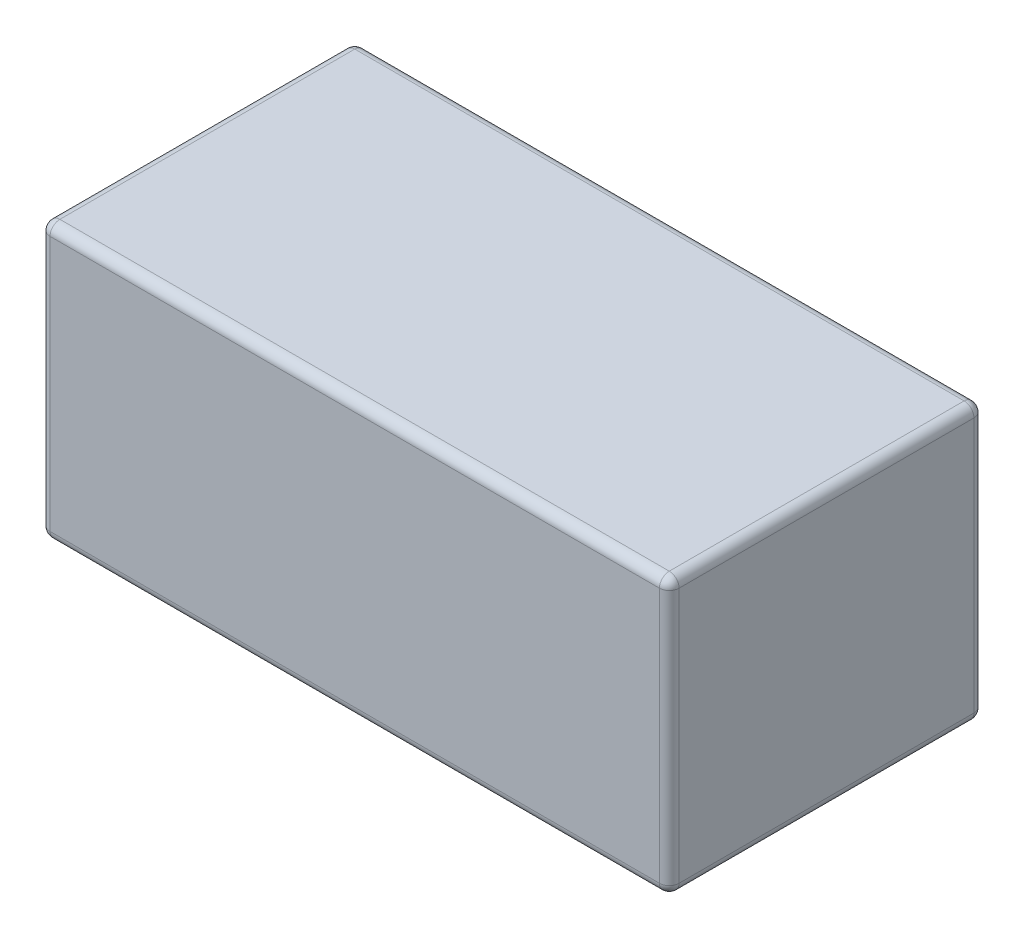
ISO-10303-21;
HEADER;
FILE_DESCRIPTION(('STEP AP214'),'2;1');
FILE_NAME('part.step','',(''),(''),'','','');
FILE_SCHEMA(('AUTOMOTIVE_DESIGN { 1 0 10303 214 1 1 1 1 }'));
ENDSEC;
DATA;
#1=APPLICATION_CONTEXT('core data for automotive mechanical design processes');
#2=APPLICATION_PROTOCOL_DEFINITION('international standard','automotive_design',2000,#1);
#3=PRODUCT_CONTEXT('',#1,'mechanical');
#4=PRODUCT('Part','Part','',(#3));
#5=PRODUCT_RELATED_PRODUCT_CATEGORY('part','',(#4));
#6=PRODUCT_DEFINITION_FORMATION('','',#4);
#7=PRODUCT_DEFINITION_CONTEXT('part definition',#1,'design');
#8=PRODUCT_DEFINITION('design','',#6,#7);
#9=PRODUCT_DEFINITION_SHAPE('','',#8);
#10=(LENGTH_UNIT() NAMED_UNIT(*) SI_UNIT(.MILLI.,.METRE.));
#11=(NAMED_UNIT(*) PLANE_ANGLE_UNIT() SI_UNIT($,.RADIAN.));
#12=(NAMED_UNIT(*) SI_UNIT($,.STERADIAN.) SOLID_ANGLE_UNIT());
#13=UNCERTAINTY_MEASURE_WITH_UNIT(LENGTH_MEASURE(1.E-05),#10,'distance_accuracy_value','');
#14=(GEOMETRIC_REPRESENTATION_CONTEXT(3) GLOBAL_UNCERTAINTY_ASSIGNED_CONTEXT((#13)) GLOBAL_UNIT_ASSIGNED_CONTEXT((#10,
#11,#12)) REPRESENTATION_CONTEXT('',''));
#15=CARTESIAN_POINT('',(0.,0.,0.));
#16=DIRECTION('',(0.,0.,1.));
#17=DIRECTION('',(1.,0.,0.));
#18=AXIS2_PLACEMENT_3D('',#15,#16,#17);
#19=CARTESIAN_POINT('',(1.55,0.05,0.75));
#20=DIRECTION('',(1.,0.,0.));
#21=DIRECTION('',(0.,0.,-1.));
#22=AXIS2_PLACEMENT_3D('',#19,#20,#21);
#23=SPHERICAL_SURFACE('',#22,0.05);
#24=CARTESIAN_POINT('',(1.55,0.05,0.75));
#25=DIRECTION('',(-1.,0.,0.));
#26=DIRECTION('',(0.,0.,1.));
#27=AXIS2_PLACEMENT_3D('',#24,#25,#26);
#28=CIRCLE('',#27,0.05);
#29=CARTESIAN_POINT('',(1.55,0.,0.75));
#30=VERTEX_POINT('',#29);
#31=CARTESIAN_POINT('',(1.55,0.0500000000000239,0.8));
#32=VERTEX_POINT('',#31);
#33=EDGE_CURVE('E111',#30,#32,#28,.T.);
#34=ORIENTED_EDGE('',*,*,#33,.F.);
#35=CARTESIAN_POINT('',(1.55,0.05,0.75));
#36=DIRECTION('',(0.,0.,1.));
#37=DIRECTION('',(1.,0.,0.));
#38=AXIS2_PLACEMENT_3D('',#35,#36,#37);
#39=CIRCLE('',#38,0.05);
#40=CARTESIAN_POINT('',(1.6,0.05,0.75));
#41=VERTEX_POINT('',#40);
#42=EDGE_CURVE('E122',#41,#30,#39,.F.);
#43=ORIENTED_EDGE('',*,*,#42,.F.);
#44=CARTESIAN_POINT('',(1.55,0.0499999999999999,0.75));
#45=DIRECTION('',(0.,-1.,0.));
#46=DIRECTION('',(0.,0.,-1.));
#47=AXIS2_PLACEMENT_3D('',#44,#45,#46);
#48=CIRCLE('',#47,0.05);
#49=EDGE_CURVE('E131',#32,#41,#48,.F.);
#50=ORIENTED_EDGE('',*,*,#49,.F.);
#51=EDGE_LOOP('',(#34,#43,#50));
#52=FACE_BOUND('',#51,.T.);
#53=ADVANCED_FACE('F17',(#52),#23,.T.);
#54=CARTESIAN_POINT('',(-1.55,0.05,0.75));
#55=DIRECTION('',(1.,0.,0.));
#56=DIRECTION('',(0.,0.,-1.));
#57=AXIS2_PLACEMENT_3D('',#54,#55,#56);
#58=SPHERICAL_SURFACE('',#57,0.05);
#59=CARTESIAN_POINT('',(-1.55,0.0499999999999999,0.75));
#60=DIRECTION('',(0.,-1.,0.));
#61=DIRECTION('',(0.,0.,-1.));
#62=AXIS2_PLACEMENT_3D('',#59,#60,#61);
#63=CIRCLE('',#62,0.05);
#64=CARTESIAN_POINT('',(-1.6,0.05,0.75));
#65=VERTEX_POINT('',#64);
#66=CARTESIAN_POINT('',(-1.55,0.05,0.8));
#67=VERTEX_POINT('',#66);
#68=EDGE_CURVE('E262',#65,#67,#63,.F.);
#69=ORIENTED_EDGE('',*,*,#68,.F.);
#70=CARTESIAN_POINT('',(-1.55,0.05,0.75));
#71=DIRECTION('',(0.,0.,-1.));
#72=DIRECTION('',(-1.,0.,0.));
#73=AXIS2_PLACEMENT_3D('',#70,#71,#72);
#74=CIRCLE('',#73,0.05);
#75=CARTESIAN_POINT('',(-1.55,0.,0.75));
#76=VERTEX_POINT('',#75);
#77=EDGE_CURVE('E271',#76,#65,#74,.T.);
#78=ORIENTED_EDGE('',*,*,#77,.F.);
#79=CARTESIAN_POINT('',(-1.55,0.05,0.75));
#80=DIRECTION('',(-1.,0.,0.));
#81=DIRECTION('',(0.,0.,1.));
#82=AXIS2_PLACEMENT_3D('',#79,#80,#81);
#83=CIRCLE('',#82,0.05);
#84=EDGE_CURVE('E114',#67,#76,#83,.F.);
#85=ORIENTED_EDGE('',*,*,#84,.F.);
#86=EDGE_LOOP('',(#69,#78,#85));
#87=FACE_BOUND('',#86,.T.);
#88=ADVANCED_FACE('F153',(#87),#58,.T.);
#89=CARTESIAN_POINT('',(-1.55,0.05,-0.75));
#90=DIRECTION('',(1.,0.,0.));
#91=DIRECTION('',(0.,0.,-1.));
#92=AXIS2_PLACEMENT_3D('',#89,#90,#91);
#93=SPHERICAL_SURFACE('',#92,0.05);
#94=CARTESIAN_POINT('',(-1.55,0.0499999999999999,-0.75));
#95=DIRECTION('',(0.,-1.,0.));
#96=DIRECTION('',(0.,0.,-1.));
#97=AXIS2_PLACEMENT_3D('',#94,#95,#96);
#98=CIRCLE('',#97,0.05);
#99=CARTESIAN_POINT('',(-1.55,0.05,-0.8));
#100=VERTEX_POINT('',#99);
#101=CARTESIAN_POINT('',(-1.6,0.05,-0.75));
#102=VERTEX_POINT('',#101);
#103=EDGE_CURVE('E257',#100,#102,#98,.F.);
#104=ORIENTED_EDGE('',*,*,#103,.F.);
#105=CARTESIAN_POINT('',(-1.55,0.05,-0.75));
#106=DIRECTION('',(1.,0.,0.));
#107=DIRECTION('',(0.,0.,-1.));
#108=AXIS2_PLACEMENT_3D('',#105,#106,#107);
#109=CIRCLE('',#108,0.05);
#110=CARTESIAN_POINT('',(-1.55,0.,-0.75));
#111=VERTEX_POINT('',#110);
#112=EDGE_CURVE('E254',#111,#100,#109,.T.);
#113=ORIENTED_EDGE('',*,*,#112,.F.);
#114=CARTESIAN_POINT('',(-1.55,0.05,-0.75));
#115=DIRECTION('',(0.,0.,-1.));
#116=DIRECTION('',(-1.,0.,0.));
#117=AXIS2_PLACEMENT_3D('',#114,#115,#116);
#118=CIRCLE('',#117,0.05);
#119=EDGE_CURVE('E268',#102,#111,#118,.F.);
#120=ORIENTED_EDGE('',*,*,#119,.F.);
#121=EDGE_LOOP('',(#104,#113,#120));
#122=FACE_BOUND('',#121,.T.);
#123=ADVANCED_FACE('F149',(#122),#93,.T.);
#124=CARTESIAN_POINT('',(1.55,0.05,-0.75));
#125=DIRECTION('',(1.,0.,0.));
#126=DIRECTION('',(0.,0.,-1.));
#127=AXIS2_PLACEMENT_3D('',#124,#125,#126);
#128=SPHERICAL_SURFACE('',#127,0.05);
#129=CARTESIAN_POINT('',(1.55,0.05,-0.75));
#130=DIRECTION('',(1.,0.,0.));
#131=DIRECTION('',(0.,0.,-1.));
#132=AXIS2_PLACEMENT_3D('',#129,#130,#131);
#133=CIRCLE('',#132,0.05);
#134=CARTESIAN_POINT('',(1.55,0.05,-0.8));
#135=VERTEX_POINT('',#134);
#136=CARTESIAN_POINT('',(1.55,0.,-0.75));
#137=VERTEX_POINT('',#136);
#138=EDGE_CURVE('E252',#135,#137,#133,.F.);
#139=ORIENTED_EDGE('',*,*,#138,.F.);
#140=CARTESIAN_POINT('',(1.55,0.0499999999999999,-0.75));
#141=DIRECTION('',(0.,-1.,0.));
#142=DIRECTION('',(0.,0.,-1.));
#143=AXIS2_PLACEMENT_3D('',#140,#141,#142);
#144=CIRCLE('',#143,0.05);
#145=CARTESIAN_POINT('',(1.6,0.05,-0.75));
#146=VERTEX_POINT('',#145);
#147=EDGE_CURVE('E259',#146,#135,#144,.F.);
#148=ORIENTED_EDGE('',*,*,#147,.F.);
#149=CARTESIAN_POINT('',(1.55,0.05,-0.75));
#150=DIRECTION('',(0.,0.,1.));
#151=DIRECTION('',(1.,0.,0.));
#152=AXIS2_PLACEMENT_3D('',#149,#150,#151);
#153=CIRCLE('',#152,0.05);
#154=EDGE_CURVE('E135',#137,#146,#153,.T.);
#155=ORIENTED_EDGE('',*,*,#154,.F.);
#156=EDGE_LOOP('',(#139,#148,#155));
#157=FACE_BOUND('',#156,.T.);
#158=ADVANCED_FACE('F145',(#157),#128,.T.);
#159=CARTESIAN_POINT('',(1.55,0.05,0.8));
#160=DIRECTION('',(0.,0.,1.));
#161=DIRECTION('',(1.,0.,0.));
#162=AXIS2_PLACEMENT_3D('',#159,#160,#161);
#163=CYLINDRICAL_SURFACE('',#162,0.05);
#164=ORIENTED_EDGE('',*,*,#154,.T.);
#165=DIRECTION('',(0.,0.,1.));
#166=VECTOR('',#165,1.);
#167=CARTESIAN_POINT('',(1.6,0.0499999999999999,0.8));
#168=LINE('',#167,#166);
#169=EDGE_CURVE('E127',#146,#41,#168,.T.);
#170=ORIENTED_EDGE('',*,*,#169,.T.);
#171=ORIENTED_EDGE('',*,*,#42,.T.);
#172=DIRECTION('',(0.,0.,1.));
#173=VECTOR('',#172,1.);
#174=CARTESIAN_POINT('',(1.55,0.,0.8));
#175=LINE('',#174,#173);
#176=EDGE_CURVE('E124',#30,#137,#175,.F.);
#177=ORIENTED_EDGE('',*,*,#176,.T.);
#178=EDGE_LOOP('',(#164,#170,#171,#177));
#179=FACE_BOUND('',#178,.T.);
#180=ADVANCED_FACE('F123',(#179),#163,.T.);
#181=CARTESIAN_POINT('',(1.55,1.4,0.75));
#182=DIRECTION('',(0.,-1.,0.));
#183=DIRECTION('',(0.,0.,-1.));
#184=AXIS2_PLACEMENT_3D('',#181,#182,#183);
#185=CYLINDRICAL_SURFACE('',#184,0.05);
#186=ORIENTED_EDGE('',*,*,#49,.T.);
#187=DIRECTION('',(0.,1.,0.));
#188=VECTOR('',#187,1.);
#189=CARTESIAN_POINT('',(1.6,1.4,0.75));
#190=LINE('',#189,#188);
#191=CARTESIAN_POINT('',(1.6,1.35,0.75));
#192=VERTEX_POINT('',#191);
#193=EDGE_CURVE('E248',#41,#192,#190,.T.);
#194=ORIENTED_EDGE('',*,*,#193,.T.);
#195=CARTESIAN_POINT('',(1.55,1.35,0.75));
#196=DIRECTION('',(0.,-1.,0.));
#197=DIRECTION('',(0.,0.,-1.));
#198=AXIS2_PLACEMENT_3D('',#195,#196,#197);
#199=CIRCLE('',#198,0.05);
#200=CARTESIAN_POINT('',(1.55,1.35,0.8));
#201=VERTEX_POINT('',#200);
#202=EDGE_CURVE('E137',#192,#201,#199,.T.);
#203=ORIENTED_EDGE('',*,*,#202,.T.);
#204=DIRECTION('',(0.,1.,0.));
#205=VECTOR('',#204,1.);
#206=CARTESIAN_POINT('',(1.55,1.4,0.8));
#207=LINE('',#206,#205);
#208=EDGE_CURVE('E117',#201,#32,#207,.F.);
#209=ORIENTED_EDGE('',*,*,#208,.T.);
#210=EDGE_LOOP('',(#186,#194,#203,#209));
#211=FACE_BOUND('',#210,.T.);
#212=ADVANCED_FACE('F277',(#211),#185,.T.);
#213=CARTESIAN_POINT('',(-1.55,0.05,0.8));
#214=DIRECTION('',(0.,0.,-1.));
#215=DIRECTION('',(-1.,0.,0.));
#216=AXIS2_PLACEMENT_3D('',#213,#214,#215);
#217=CYLINDRICAL_SURFACE('',#216,0.05);
#218=ORIENTED_EDGE('',*,*,#119,.T.);
#219=DIRECTION('',(0.,0.,-1.));
#220=VECTOR('',#219,1.);
#221=CARTESIAN_POINT('',(-1.55,0.,0.8));
#222=LINE('',#221,#220);
#223=EDGE_CURVE('E265',#111,#76,#222,.F.);
#224=ORIENTED_EDGE('',*,*,#223,.T.);
#225=ORIENTED_EDGE('',*,*,#77,.T.);
#226=DIRECTION('',(0.,0.,-1.));
#227=VECTOR('',#226,1.);
#228=CARTESIAN_POINT('',(-1.6,0.0499999999999999,0.8));
#229=LINE('',#228,#227);
#230=EDGE_CURVE('E222',#65,#102,#229,.T.);
#231=ORIENTED_EDGE('',*,*,#230,.T.);
#232=EDGE_LOOP('',(#218,#224,#225,#231));
#233=FACE_BOUND('',#232,.T.);
#234=ADVANCED_FACE('F343',(#233),#217,.T.);
#235=CARTESIAN_POINT('',(-1.55,1.4,0.75));
#236=DIRECTION('',(0.,-1.,0.));
#237=DIRECTION('',(0.,0.,-1.));
#238=AXIS2_PLACEMENT_3D('',#235,#236,#237);
#239=CYLINDRICAL_SURFACE('',#238,0.05);
#240=ORIENTED_EDGE('',*,*,#68,.T.);
#241=DIRECTION('',(0.,1.,0.));
#242=VECTOR('',#241,1.);
#243=CARTESIAN_POINT('',(-1.55,1.4,0.8));
#244=LINE('',#243,#242);
#245=CARTESIAN_POINT('',(-1.55,1.35,0.8));
#246=VERTEX_POINT('',#245);
#247=EDGE_CURVE('E116',#67,#246,#244,.T.);
#248=ORIENTED_EDGE('',*,*,#247,.T.);
#249=CARTESIAN_POINT('',(-1.55,1.35,0.75));
#250=DIRECTION('',(0.,-1.,0.));
#251=DIRECTION('',(1.,0.,0.));
#252=AXIS2_PLACEMENT_3D('',#249,#250,#251);
#253=CIRCLE('',#252,0.05);
#254=CARTESIAN_POINT('',(-1.6,1.35,0.75));
#255=VERTEX_POINT('',#254);
#256=EDGE_CURVE('E225',#255,#246,#253,.F.);
#257=ORIENTED_EDGE('',*,*,#256,.F.);
#258=DIRECTION('',(0.,1.,0.));
#259=VECTOR('',#258,1.);
#260=CARTESIAN_POINT('',(-1.6,1.4,0.75));
#261=LINE('',#260,#259);
#262=EDGE_CURVE('E216',#255,#65,#261,.F.);
#263=ORIENTED_EDGE('',*,*,#262,.T.);
#264=EDGE_LOOP('',(#240,#248,#257,#263));
#265=FACE_BOUND('',#264,.T.);
#266=ADVANCED_FACE('F340',(#265),#239,.T.);
#267=CARTESIAN_POINT('',(1.55,1.4,-0.75));
#268=DIRECTION('',(0.,-1.,0.));
#269=DIRECTION('',(0.,0.,-1.));
#270=AXIS2_PLACEMENT_3D('',#267,#268,#269);
#271=CYLINDRICAL_SURFACE('',#270,0.05);
#272=ORIENTED_EDGE('',*,*,#147,.T.);
#273=DIRECTION('',(0.,1.,0.));
#274=VECTOR('',#273,1.);
#275=CARTESIAN_POINT('',(1.55,1.4,-0.8));
#276=LINE('',#275,#274);
#277=CARTESIAN_POINT('',(1.55,1.35,-0.8));
#278=VERTEX_POINT('',#277);
#279=EDGE_CURVE('E208',#135,#278,#276,.T.);
#280=ORIENTED_EDGE('',*,*,#279,.T.);
#281=CARTESIAN_POINT('',(1.55,1.35,-0.75));
#282=DIRECTION('',(0.,1.,0.));
#283=DIRECTION('',(1.,0.,0.));
#284=AXIS2_PLACEMENT_3D('',#281,#282,#283);
#285=CIRCLE('',#284,0.05);
#286=CARTESIAN_POINT('',(1.6,1.35,-0.75));
#287=VERTEX_POINT('',#286);
#288=EDGE_CURVE('E210',#287,#278,#285,.T.);
#289=ORIENTED_EDGE('',*,*,#288,.F.);
#290=DIRECTION('',(0.,1.,0.));
#291=VECTOR('',#290,1.);
#292=CARTESIAN_POINT('',(1.6,1.4,-0.75));
#293=LINE('',#292,#291);
#294=EDGE_CURVE('E245',#287,#146,#293,.F.);
#295=ORIENTED_EDGE('',*,*,#294,.T.);
#296=EDGE_LOOP('',(#272,#280,#289,#295));
#297=FACE_BOUND('',#296,.T.);
#298=ADVANCED_FACE('F312',(#297),#271,.T.);
#299=CARTESIAN_POINT('',(-1.55,1.4,-0.75));
#300=DIRECTION('',(0.,-1.,0.));
#301=DIRECTION('',(0.,0.,-1.));
#302=AXIS2_PLACEMENT_3D('',#299,#300,#301);
#303=CYLINDRICAL_SURFACE('',#302,0.05);
#304=CARTESIAN_POINT('',(-1.55,1.35,-0.75));
#305=DIRECTION('',(0.,1.,0.));
#306=DIRECTION('',(1.,0.,0.));
#307=AXIS2_PLACEMENT_3D('',#304,#305,#306);
#308=CIRCLE('',#307,0.05);
#309=CARTESIAN_POINT('',(-1.55,1.35,-0.8));
#310=VERTEX_POINT('',#309);
#311=CARTESIAN_POINT('',(-1.6,1.35,-0.75));
#312=VERTEX_POINT('',#311);
#313=EDGE_CURVE('E212',#310,#312,#308,.T.);
#314=ORIENTED_EDGE('',*,*,#313,.F.);
#315=DIRECTION('',(0.,1.,0.));
#316=VECTOR('',#315,1.);
#317=CARTESIAN_POINT('',(-1.55,1.4,-0.8));
#318=LINE('',#317,#316);
#319=EDGE_CURVE('E302',#310,#100,#318,.F.);
#320=ORIENTED_EDGE('',*,*,#319,.T.);
#321=ORIENTED_EDGE('',*,*,#103,.T.);
#322=DIRECTION('',(0.,1.,0.));
#323=VECTOR('',#322,1.);
#324=CARTESIAN_POINT('',(-1.6,1.4,-0.75));
#325=LINE('',#324,#323);
#326=EDGE_CURVE('E219',#102,#312,#325,.T.);
#327=ORIENTED_EDGE('',*,*,#326,.T.);
#328=EDGE_LOOP('',(#314,#320,#321,#327));
#329=FACE_BOUND('',#328,.T.);
#330=ADVANCED_FACE('F360',(#329),#303,.T.);
#331=CARTESIAN_POINT('',(1.6,0.,-0.8));
#332=DIRECTION('',(0.,-1.,0.));
#333=DIRECTION('',(0.,0.,-1.));
#334=AXIS2_PLACEMENT_3D('',#331,#332,#333);
#335=PLANE('',#334);
#336=DIRECTION('',(1.,0.,0.));
#337=VECTOR('',#336,1.);
#338=CARTESIAN_POINT('',(-1.6,0.,-0.75));
#339=LINE('',#338,#337);
#340=EDGE_CURVE('E101',#137,#111,#339,.F.);
#341=ORIENTED_EDGE('',*,*,#340,.F.);
#342=ORIENTED_EDGE('',*,*,#176,.F.);
#343=DIRECTION('',(-1.,0.,0.));
#344=VECTOR('',#343,1.);
#345=CARTESIAN_POINT('',(-1.6,0.,0.75));
#346=LINE('',#345,#344);
#347=EDGE_CURVE('E107',#76,#30,#346,.F.);
#348=ORIENTED_EDGE('',*,*,#347,.F.);
#349=ORIENTED_EDGE('',*,*,#223,.F.);
#350=EDGE_LOOP('',(#341,#342,#348,#349));
#351=FACE_BOUND('',#350,.T.);
#352=ADVANCED_FACE('F134',(#351),#335,.T.);
#353=CARTESIAN_POINT('',(1.6,1.4,0.8));
#354=DIRECTION('',(-1.,0.,0.));
#355=DIRECTION('',(0.,0.,1.));
#356=AXIS2_PLACEMENT_3D('',#353,#354,#355);
#357=PLANE('',#356);
#358=DIRECTION('',(0.,0.,-1.));
#359=VECTOR('',#358,1.);
#360=CARTESIAN_POINT('',(1.6,1.35,-0.8));
#361=LINE('',#360,#359);
#362=EDGE_CURVE('E295',#192,#287,#361,.T.);
#363=ORIENTED_EDGE('',*,*,#362,.F.);
#364=ORIENTED_EDGE('',*,*,#193,.F.);
#365=ORIENTED_EDGE('',*,*,#169,.F.);
#366=ORIENTED_EDGE('',*,*,#294,.F.);
#367=EDGE_LOOP('',(#363,#364,#365,#366));
#368=FACE_BOUND('',#367,.T.);
#369=ADVANCED_FACE('F350',(#368),#357,.F.);
#370=CARTESIAN_POINT('',(-1.6,0.05,0.75));
#371=DIRECTION('',(-1.,0.,0.));
#372=DIRECTION('',(0.,0.,1.));
#373=AXIS2_PLACEMENT_3D('',#370,#371,#372);
#374=CYLINDRICAL_SURFACE('',#373,0.05);
#375=ORIENTED_EDGE('',*,*,#347,.T.);
#376=ORIENTED_EDGE('',*,*,#33,.T.);
#377=DIRECTION('',(-1.,0.,0.));
#378=VECTOR('',#377,1.);
#379=CARTESIAN_POINT('',(-1.6,0.0499999999999999,0.8));
#380=LINE('',#379,#378);
#381=EDGE_CURVE('E287',#32,#67,#380,.T.);
#382=ORIENTED_EDGE('',*,*,#381,.T.);
#383=ORIENTED_EDGE('',*,*,#84,.T.);
#384=EDGE_LOOP('',(#375,#376,#382,#383));
#385=FACE_BOUND('',#384,.T.);
#386=ADVANCED_FACE('F109',(#385),#374,.T.);
#387=CARTESIAN_POINT('',(1.55,1.35,0.75));
#388=DIRECTION('',(1.,0.,0.));
#389=DIRECTION('',(0.,0.,-1.));
#390=AXIS2_PLACEMENT_3D('',#387,#388,#389);
#391=SPHERICAL_SURFACE('',#390,0.05);
#392=ORIENTED_EDGE('',*,*,#202,.F.);
#393=CARTESIAN_POINT('',(1.55,1.35,0.75));
#394=DIRECTION('',(0.,0.,-1.));
#395=DIRECTION('',(-1.,0.,0.));
#396=AXIS2_PLACEMENT_3D('',#393,#394,#395);
#397=CIRCLE('',#396,0.05);
#398=CARTESIAN_POINT('',(1.55,1.4,0.75));
#399=VERTEX_POINT('',#398);
#400=EDGE_CURVE('E284',#399,#192,#397,.T.);
#401=ORIENTED_EDGE('',*,*,#400,.F.);
#402=CARTESIAN_POINT('',(1.55,1.35,0.75));
#403=DIRECTION('',(1.,0.,0.));
#404=DIRECTION('',(0.,0.,-1.));
#405=AXIS2_PLACEMENT_3D('',#402,#403,#404);
#406=CIRCLE('',#405,0.05);
#407=EDGE_CURVE('E283',#201,#399,#406,.F.);
#408=ORIENTED_EDGE('',*,*,#407,.F.);
#409=EDGE_LOOP('',(#392,#401,#408));
#410=FACE_BOUND('',#409,.T.);
#411=ADVANCED_FACE('F234',(#410),#391,.T.);
#412=CARTESIAN_POINT('',(-1.55,1.35,0.75));
#413=DIRECTION('',(1.,0.,0.));
#414=DIRECTION('',(0.,0.,-1.));
#415=AXIS2_PLACEMENT_3D('',#412,#413,#414);
#416=SPHERICAL_SURFACE('',#415,0.05);
#417=ORIENTED_EDGE('',*,*,#256,.T.);
#418=CARTESIAN_POINT('',(-1.55,1.35,0.75));
#419=DIRECTION('',(1.,0.,0.));
#420=DIRECTION('',(0.,0.,-1.));
#421=AXIS2_PLACEMENT_3D('',#418,#419,#420);
#422=CIRCLE('',#421,0.05);
#423=CARTESIAN_POINT('',(-1.55,1.4,0.75));
#424=VERTEX_POINT('',#423);
#425=EDGE_CURVE('E286',#424,#246,#422,.T.);
#426=ORIENTED_EDGE('',*,*,#425,.F.);
#427=CARTESIAN_POINT('',(-1.55,1.35,0.75));
#428=DIRECTION('',(0.,0.,1.));
#429=DIRECTION('',(1.,0.,0.));
#430=AXIS2_PLACEMENT_3D('',#427,#428,#429);
#431=CIRCLE('',#430,0.05);
#432=EDGE_CURVE('E333',#255,#424,#431,.F.);
#433=ORIENTED_EDGE('',*,*,#432,.F.);
#434=EDGE_LOOP('',(#417,#426,#433));
#435=FACE_BOUND('',#434,.T.);
#436=ADVANCED_FACE('F230',(#435),#416,.T.);
#437=CARTESIAN_POINT('',(-1.6,1.4,0.8));
#438=DIRECTION('',(1.,0.,0.));
#439=DIRECTION('',(0.,0.,-1.));
#440=AXIS2_PLACEMENT_3D('',#437,#438,#439);
#441=PLANE('',#440);
#442=DIRECTION('',(0.,0.,1.));
#443=VECTOR('',#442,1.);
#444=CARTESIAN_POINT('',(-1.6,1.35,-0.8));
#445=LINE('',#444,#443);
#446=EDGE_CURVE('E324',#312,#255,#445,.T.);
#447=ORIENTED_EDGE('',*,*,#446,.F.);
#448=ORIENTED_EDGE('',*,*,#326,.F.);
#449=ORIENTED_EDGE('',*,*,#230,.F.);
#450=ORIENTED_EDGE('',*,*,#262,.F.);
#451=EDGE_LOOP('',(#447,#448,#449,#450));
#452=FACE_BOUND('',#451,.T.);
#453=ADVANCED_FACE('F233',(#452),#441,.F.);
#454=CARTESIAN_POINT('',(-1.55,1.35,-0.75));
#455=DIRECTION('',(1.,0.,0.));
#456=DIRECTION('',(0.,0.,-1.));
#457=AXIS2_PLACEMENT_3D('',#454,#455,#456);
#458=SPHERICAL_SURFACE('',#457,0.05);
#459=CARTESIAN_POINT('',(-1.55,1.35,-0.75));
#460=DIRECTION('',(0.,0.,1.));
#461=DIRECTION('',(1.,0.,0.));
#462=AXIS2_PLACEMENT_3D('',#459,#460,#461);
#463=CIRCLE('',#462,0.05);
#464=CARTESIAN_POINT('',(-1.55,1.4,-0.75));
#465=VERTEX_POINT('',#464);
#466=EDGE_CURVE('E330',#465,#312,#463,.T.);
#467=ORIENTED_EDGE('',*,*,#466,.F.);
#468=CARTESIAN_POINT('',(-1.55,1.35,-0.75));
#469=DIRECTION('',(-1.,0.,0.));
#470=DIRECTION('',(0.,0.,1.));
#471=AXIS2_PLACEMENT_3D('',#468,#469,#470);
#472=CIRCLE('',#471,0.05);
#473=EDGE_CURVE('E320',#310,#465,#472,.F.);
#474=ORIENTED_EDGE('',*,*,#473,.F.);
#475=ORIENTED_EDGE('',*,*,#313,.T.);
#476=EDGE_LOOP('',(#467,#474,#475));
#477=FACE_BOUND('',#476,.T.);
#478=ADVANCED_FACE('F201',(#477),#458,.T.);
#479=CARTESIAN_POINT('',(1.55,1.35,-0.75));
#480=DIRECTION('',(1.,0.,0.));
#481=DIRECTION('',(0.,0.,-1.));
#482=AXIS2_PLACEMENT_3D('',#479,#480,#481);
#483=SPHERICAL_SURFACE('',#482,0.05);
#484=CARTESIAN_POINT('',(1.55,1.35,-0.75));
#485=DIRECTION('',(0.,0.,-1.));
#486=DIRECTION('',(-1.,0.,0.));
#487=AXIS2_PLACEMENT_3D('',#484,#485,#486);
#488=CIRCLE('',#487,0.05);
#489=CARTESIAN_POINT('',(1.55,1.4,-0.75));
#490=VERTEX_POINT('',#489);
#491=EDGE_CURVE('E292',#287,#490,#488,.F.);
#492=ORIENTED_EDGE('',*,*,#491,.F.);
#493=ORIENTED_EDGE('',*,*,#288,.T.);
#494=CARTESIAN_POINT('',(1.55,1.35,-0.75));
#495=DIRECTION('',(-1.,0.,0.));
#496=DIRECTION('',(0.,0.,1.));
#497=AXIS2_PLACEMENT_3D('',#494,#495,#496);
#498=CIRCLE('',#497,0.05);
#499=EDGE_CURVE('E317',#490,#278,#498,.T.);
#500=ORIENTED_EDGE('',*,*,#499,.F.);
#501=EDGE_LOOP('',(#492,#493,#500));
#502=FACE_BOUND('',#501,.T.);
#503=ADVANCED_FACE('F196',(#502),#483,.T.);
#504=CARTESIAN_POINT('',(-1.6,0.05,-0.75));
#505=DIRECTION('',(1.,0.,0.));
#506=DIRECTION('',(0.,0.,-1.));
#507=AXIS2_PLACEMENT_3D('',#504,#505,#506);
#508=CYLINDRICAL_SURFACE('',#507,0.05);
#509=DIRECTION('',(1.,0.,0.));
#510=VECTOR('',#509,1.);
#511=CARTESIAN_POINT('',(-1.6,0.0499999999999999,-0.8));
#512=LINE('',#511,#510);
#513=EDGE_CURVE('E319',#100,#135,#512,.T.);
#514=ORIENTED_EDGE('',*,*,#513,.T.);
#515=ORIENTED_EDGE('',*,*,#138,.T.);
#516=ORIENTED_EDGE('',*,*,#340,.T.);
#517=ORIENTED_EDGE('',*,*,#112,.T.);
#518=EDGE_LOOP('',(#514,#515,#516,#517));
#519=FACE_BOUND('',#518,.T.);
#520=ADVANCED_FACE('F192',(#519),#508,.T.);
#521=CARTESIAN_POINT('',(1.55,1.35,-0.8));
#522=DIRECTION('',(0.,0.,-1.));
#523=DIRECTION('',(-1.,0.,0.));
#524=AXIS2_PLACEMENT_3D('',#521,#522,#523);
#525=CYLINDRICAL_SURFACE('',#524,0.05);
#526=ORIENTED_EDGE('',*,*,#491,.T.);
#527=DIRECTION('',(0.,0.,-1.));
#528=VECTOR('',#527,1.);
#529=CARTESIAN_POINT('',(1.55,1.4,-0.8));
#530=LINE('',#529,#528);
#531=EDGE_CURVE('E322',#490,#399,#530,.F.);
#532=ORIENTED_EDGE('',*,*,#531,.T.);
#533=ORIENTED_EDGE('',*,*,#400,.T.);
#534=ORIENTED_EDGE('',*,*,#362,.T.);
#535=EDGE_LOOP('',(#526,#532,#533,#534));
#536=FACE_BOUND('',#535,.T.);
#537=ADVANCED_FACE('F188',(#536),#525,.T.);
#538=CARTESIAN_POINT('',(-1.6,1.4,0.8));
#539=DIRECTION('',(0.,0.,-1.));
#540=DIRECTION('',(-1.,0.,0.));
#541=AXIS2_PLACEMENT_3D('',#538,#539,#540);
#542=PLANE('',#541);
#543=DIRECTION('',(1.,0.,0.));
#544=VECTOR('',#543,1.);
#545=CARTESIAN_POINT('',(1.6,1.35,0.8));
#546=LINE('',#545,#544);
#547=EDGE_CURVE('E290',#246,#201,#546,.T.);
#548=ORIENTED_EDGE('',*,*,#547,.F.);
#549=ORIENTED_EDGE('',*,*,#247,.F.);
#550=ORIENTED_EDGE('',*,*,#381,.F.);
#551=ORIENTED_EDGE('',*,*,#208,.F.);
#552=EDGE_LOOP('',(#548,#549,#550,#551));
#553=FACE_BOUND('',#552,.T.);
#554=ADVANCED_FACE('F184',(#553),#542,.F.);
#555=CARTESIAN_POINT('',(-1.55,1.35,-0.8));
#556=DIRECTION('',(0.,0.,1.));
#557=DIRECTION('',(1.,0.,0.));
#558=AXIS2_PLACEMENT_3D('',#555,#556,#557);
#559=CYLINDRICAL_SURFACE('',#558,0.05);
#560=ORIENTED_EDGE('',*,*,#466,.T.);
#561=ORIENTED_EDGE('',*,*,#446,.T.);
#562=ORIENTED_EDGE('',*,*,#432,.T.);
#563=DIRECTION('',(0.,0.,-1.));
#564=VECTOR('',#563,1.);
#565=CARTESIAN_POINT('',(-1.55,1.4,-0.8));
#566=LINE('',#565,#564);
#567=EDGE_CURVE('E351',#424,#465,#566,.T.);
#568=ORIENTED_EDGE('',*,*,#567,.T.);
#569=EDGE_LOOP('',(#560,#561,#562,#568));
#570=FACE_BOUND('',#569,.T.);
#571=ADVANCED_FACE('F180',(#570),#559,.T.);
#572=CARTESIAN_POINT('',(-1.6,1.4,-0.8));
#573=DIRECTION('',(0.,0.,1.));
#574=DIRECTION('',(1.,0.,0.));
#575=AXIS2_PLACEMENT_3D('',#572,#573,#574);
#576=PLANE('',#575);
#577=ORIENTED_EDGE('',*,*,#513,.F.);
#578=ORIENTED_EDGE('',*,*,#319,.F.);
#579=DIRECTION('',(-1.,0.,0.));
#580=VECTOR('',#579,1.);
#581=CARTESIAN_POINT('',(1.6,1.35,-0.8));
#582=LINE('',#581,#580);
#583=EDGE_CURVE('E318',#278,#310,#582,.T.);
#584=ORIENTED_EDGE('',*,*,#583,.F.);
#585=ORIENTED_EDGE('',*,*,#279,.F.);
#586=EDGE_LOOP('',(#577,#578,#584,#585));
#587=FACE_BOUND('',#586,.T.);
#588=ADVANCED_FACE('F176',(#587),#576,.F.);
#589=CARTESIAN_POINT('',(1.6,1.35,0.75));
#590=DIRECTION('',(1.,0.,0.));
#591=DIRECTION('',(0.,0.,-1.));
#592=AXIS2_PLACEMENT_3D('',#589,#590,#591);
#593=CYLINDRICAL_SURFACE('',#592,0.05);
#594=ORIENTED_EDGE('',*,*,#547,.T.);
#595=ORIENTED_EDGE('',*,*,#407,.T.);
#596=DIRECTION('',(1.,0.,0.));
#597=VECTOR('',#596,1.);
#598=CARTESIAN_POINT('',(1.6,1.4,0.75));
#599=LINE('',#598,#597);
#600=EDGE_CURVE('E26',#399,#424,#599,.F.);
#601=ORIENTED_EDGE('',*,*,#600,.T.);
#602=ORIENTED_EDGE('',*,*,#425,.T.);
#603=EDGE_LOOP('',(#594,#595,#601,#602));
#604=FACE_BOUND('',#603,.T.);
#605=ADVANCED_FACE('F170',(#604),#593,.T.);
#606=CARTESIAN_POINT('',(1.6,1.35,-0.75));
#607=DIRECTION('',(-1.,0.,0.));
#608=DIRECTION('',(0.,0.,1.));
#609=AXIS2_PLACEMENT_3D('',#606,#607,#608);
#610=CYLINDRICAL_SURFACE('',#609,0.05);
#611=DIRECTION('',(1.,0.,0.));
#612=VECTOR('',#611,1.);
#613=CARTESIAN_POINT('',(1.6,1.4,-0.75));
#614=LINE('',#613,#612);
#615=EDGE_CURVE('E11',#465,#490,#614,.T.);
#616=ORIENTED_EDGE('',*,*,#615,.T.);
#617=ORIENTED_EDGE('',*,*,#499,.T.);
#618=ORIENTED_EDGE('',*,*,#583,.T.);
#619=ORIENTED_EDGE('',*,*,#473,.T.);
#620=EDGE_LOOP('',(#616,#617,#618,#619));
#621=FACE_BOUND('',#620,.T.);
#622=ADVANCED_FACE('F165',(#621),#610,.T.);
#623=CARTESIAN_POINT('',(1.6,1.4,-0.8));
#624=DIRECTION('',(0.,-1.,0.));
#625=DIRECTION('',(0.,0.,-1.));
#626=AXIS2_PLACEMENT_3D('',#623,#624,#625);
#627=PLANE('',#626);
#628=ORIENTED_EDGE('',*,*,#615,.F.);
#629=ORIENTED_EDGE('',*,*,#567,.F.);
#630=ORIENTED_EDGE('',*,*,#600,.F.);
#631=ORIENTED_EDGE('',*,*,#531,.F.);
#632=EDGE_LOOP('',(#628,#629,#630,#631));
#633=FACE_BOUND('',#632,.T.);
#634=ADVANCED_FACE('F163',(#633),#627,.F.);
#635=CLOSED_SHELL('',(#53,#88,#123,#158,#180,#212,#234,#266,#298,#330,#352,#369,#386,#411,#436,
#453,#478,#503,#520,#537,#554,#571,#588,#605,#622,#634));
#636=MANIFOLD_SOLID_BREP('B1',#635);
#637=ADVANCED_BREP_SHAPE_REPRESENTATION('',(#18,#636),#14);
#638=SHAPE_DEFINITION_REPRESENTATION(#9,#637);
ENDSEC;
END-ISO-10303-21;
